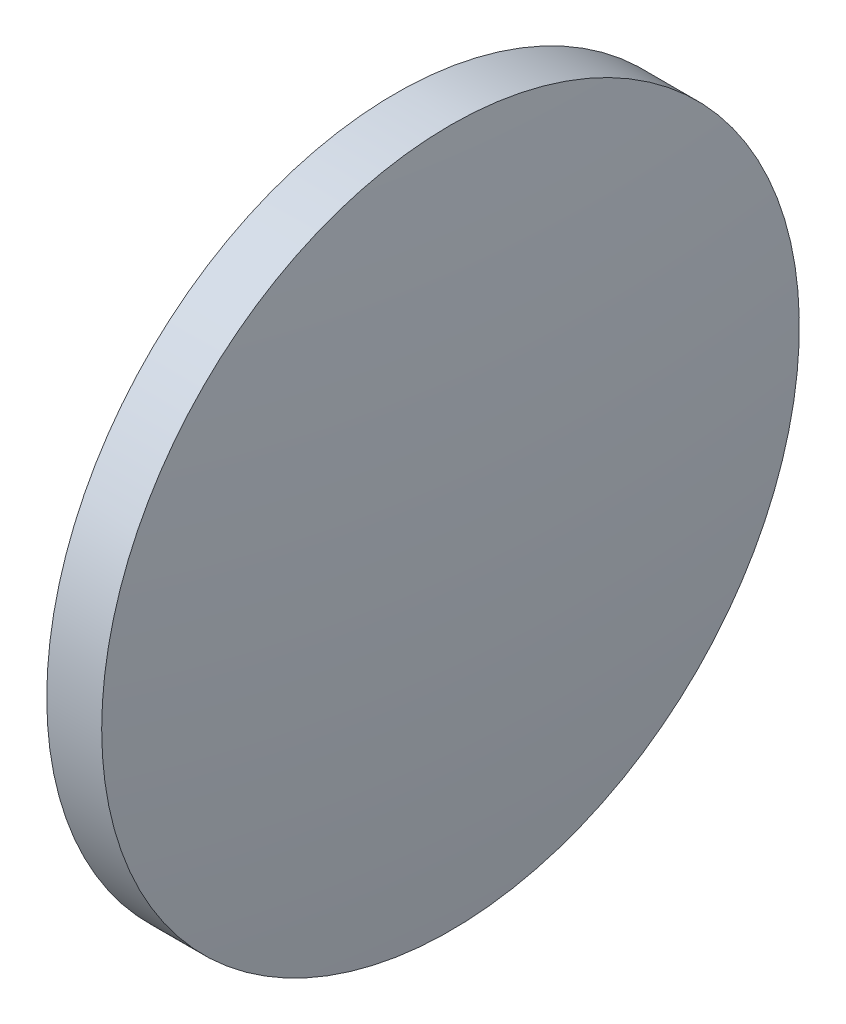
ISO-10303-21;
HEADER;
FILE_DESCRIPTION(('STEP AP214'),'2;1');
FILE_NAME('part.step','',(''),(''),'','','');
FILE_SCHEMA(('AUTOMOTIVE_DESIGN { 1 0 10303 214 1 1 1 1 }'));
ENDSEC;
DATA;
#1=APPLICATION_CONTEXT('core data for automotive mechanical design processes');
#2=APPLICATION_PROTOCOL_DEFINITION('international standard','automotive_design',2000,#1);
#3=PRODUCT_CONTEXT('',#1,'mechanical');
#4=PRODUCT('Part','Part','',(#3));
#5=PRODUCT_RELATED_PRODUCT_CATEGORY('part','',(#4));
#6=PRODUCT_DEFINITION_FORMATION('','',#4);
#7=PRODUCT_DEFINITION_CONTEXT('part definition',#1,'design');
#8=PRODUCT_DEFINITION('design','',#6,#7);
#9=PRODUCT_DEFINITION_SHAPE('','',#8);
#10=(LENGTH_UNIT() NAMED_UNIT(*) SI_UNIT(.MILLI.,.METRE.));
#11=(NAMED_UNIT(*) PLANE_ANGLE_UNIT() SI_UNIT($,.RADIAN.));
#12=(NAMED_UNIT(*) SI_UNIT($,.STERADIAN.) SOLID_ANGLE_UNIT());
#13=UNCERTAINTY_MEASURE_WITH_UNIT(LENGTH_MEASURE(1.E-05),#10,'distance_accuracy_value','');
#14=(GEOMETRIC_REPRESENTATION_CONTEXT(3) GLOBAL_UNCERTAINTY_ASSIGNED_CONTEXT((#13)) GLOBAL_UNIT_ASSIGNED_CONTEXT((#10,
#11,#12)) REPRESENTATION_CONTEXT('',''));
#15=CARTESIAN_POINT('',(0.,0.,0.));
#16=DIRECTION('',(0.,0.,1.));
#17=DIRECTION('',(1.,0.,0.));
#18=AXIS2_PLACEMENT_3D('',#15,#16,#17);
#19=CARTESIAN_POINT('',(740.619434987679,273.08874571721,0.));
#20=DIRECTION('',(-1.,0.,0.));
#21=DIRECTION('',(0.,1.,0.));
#22=AXIS2_PLACEMENT_3D('',#19,#20,#21);
#23=SPHERICAL_SURFACE('',#22,115.557142857142);
#24=CARTESIAN_POINT('',(855.476577844821,273.08874571721,0.));
#25=DIRECTION('',(-1.,0.,0.));
#26=DIRECTION('',(0.,0.,1.));
#27=AXIS2_PLACEMENT_3D('',#24,#25,#26);
#28=CIRCLE('',#27,12.7);
#29=CARTESIAN_POINT('',(855.476577844821,273.08874571721,12.7));
#30=VERTEX_POINT('',#29);
#31=EDGE_CURVE('E10',#30,#30,#28,.T.);
#32=ORIENTED_EDGE('',*,*,#31,.F.);
#33=EDGE_LOOP('',(#32));
#34=FACE_BOUND('',#33,.T.);
#35=ADVANCED_FACE('F35',(#34),#23,.T.);
#36=CARTESIAN_POINT('',(847.738359809145,273.08874571721,0.));
#37=DIRECTION('',(-1.,0.,0.));
#38=DIRECTION('',(0.,0.,1.));
#39=AXIS2_PLACEMENT_3D('',#36,#37,#38);
#40=CYLINDRICAL_SURFACE('',#39,12.7);
#41=CARTESIAN_POINT('',(853.476577844821,273.08874571721,0.));
#42=DIRECTION('',(-1.,0.,0.));
#43=DIRECTION('',(0.,0.,1.));
#44=AXIS2_PLACEMENT_3D('',#41,#42,#43);
#45=CIRCLE('',#44,12.7);
#46=CARTESIAN_POINT('',(853.476577844821,273.08874571721,12.7));
#47=VERTEX_POINT('',#46);
#48=EDGE_CURVE('E41',#47,#47,#45,.T.);
#49=ORIENTED_EDGE('',*,*,#48,.F.);
#50=EDGE_LOOP('',(#49));
#51=FACE_BOUND('',#50,.T.);
#52=ORIENTED_EDGE('',*,*,#31,.T.);
#53=EDGE_LOOP('',(#52));
#54=FACE_BOUND('',#53,.T.);
#55=ADVANCED_FACE('F49',(#51,#54),#40,.T.);
#56=CARTESIAN_POINT('',(853.476577844821,273.08874571721,0.));
#57=DIRECTION('',(1.,0.,0.));
#58=DIRECTION('',(0.,0.,-1.));
#59=AXIS2_PLACEMENT_3D('',#56,#57,#58);
#60=PLANE('',#59);
#61=ORIENTED_EDGE('',*,*,#48,.T.);
#62=EDGE_LOOP('',(#61));
#63=FACE_BOUND('',#62,.T.);
#64=ADVANCED_FACE('F47',(#63),#60,.F.);
#65=CLOSED_SHELL('',(#35,#55,#64));
#66=MANIFOLD_SOLID_BREP('B2',#65);
#67=ADVANCED_BREP_SHAPE_REPRESENTATION('',(#18,#66),#14);
#68=SHAPE_DEFINITION_REPRESENTATION(#9,#67);
ENDSEC;
END-ISO-10303-21;
